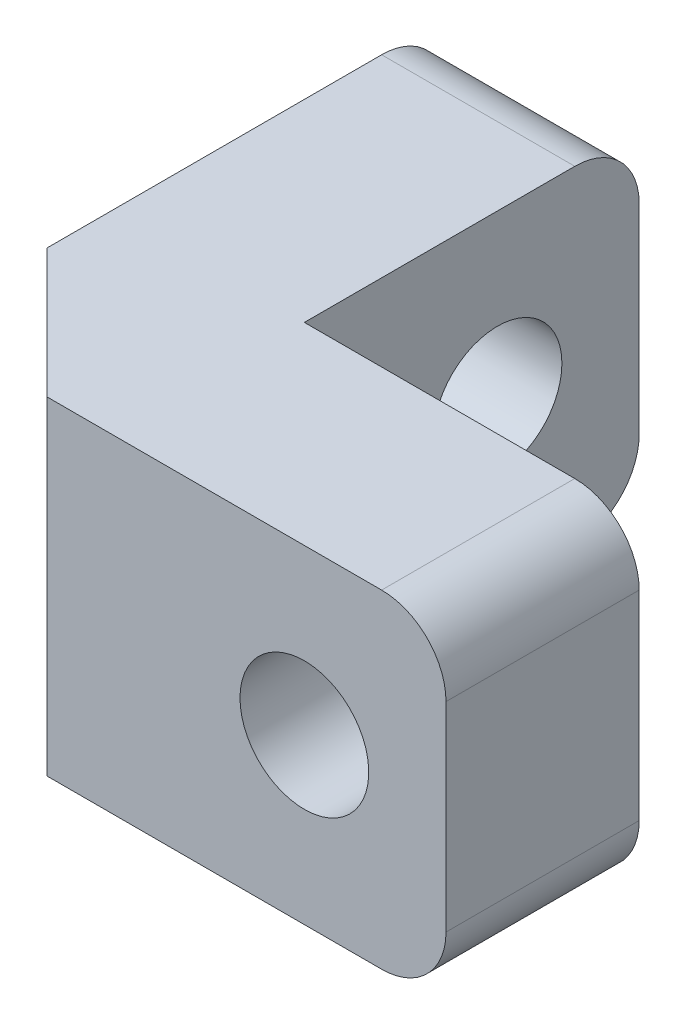
ISO-10303-21;
HEADER;
FILE_DESCRIPTION(('STEP AP214'),'2;1');
FILE_NAME('part.step','',(''),(''),'','','');
FILE_SCHEMA(('AUTOMOTIVE_DESIGN { 1 0 10303 214 1 1 1 1 }'));
ENDSEC;
DATA;
#1=APPLICATION_CONTEXT('core data for automotive mechanical design processes');
#2=APPLICATION_PROTOCOL_DEFINITION('international standard','automotive_design',2000,#1);
#3=PRODUCT_CONTEXT('',#1,'mechanical');
#4=PRODUCT('Part','Part','',(#3));
#5=PRODUCT_RELATED_PRODUCT_CATEGORY('part','',(#4));
#6=PRODUCT_DEFINITION_FORMATION('','',#4);
#7=PRODUCT_DEFINITION_CONTEXT('part definition',#1,'design');
#8=PRODUCT_DEFINITION('design','',#6,#7);
#9=PRODUCT_DEFINITION_SHAPE('','',#8);
#10=(LENGTH_UNIT() NAMED_UNIT(*) SI_UNIT(.MILLI.,.METRE.));
#11=(NAMED_UNIT(*) PLANE_ANGLE_UNIT() SI_UNIT($,.RADIAN.));
#12=(NAMED_UNIT(*) SI_UNIT($,.STERADIAN.) SOLID_ANGLE_UNIT());
#13=UNCERTAINTY_MEASURE_WITH_UNIT(LENGTH_MEASURE(1.E-05),#10,'distance_accuracy_value','');
#14=(GEOMETRIC_REPRESENTATION_CONTEXT(3) GLOBAL_UNCERTAINTY_ASSIGNED_CONTEXT((#13)) GLOBAL_UNIT_ASSIGNED_CONTEXT((#10,
#11,#12)) REPRESENTATION_CONTEXT('',''));
#15=CARTESIAN_POINT('',(0.,0.,0.));
#16=DIRECTION('',(0.,0.,1.));
#17=DIRECTION('',(1.,0.,0.));
#18=AXIS2_PLACEMENT_3D('',#15,#16,#17);
#19=CARTESIAN_POINT('',(4.7204,0.8296,1.4));
#20=DIRECTION('',(0.,0.,-1.));
#21=DIRECTION('',(-1.,0.,0.));
#22=AXIS2_PLACEMENT_3D('',#19,#20,#21);
#23=PLANE('',#22);
#24=CARTESIAN_POINT('',(3.,2.55,1.4));
#25=DIRECTION('',(0.,0.,-1.));
#26=DIRECTION('',(-1.,0.,0.));
#27=AXIS2_PLACEMENT_3D('',#24,#25,#26);
#28=CIRCLE('',#27,1.);
#29=CARTESIAN_POINT('',(2.,2.55,1.4));
#30=VERTEX_POINT('',#29);
#31=EDGE_CURVE('E21',#30,#30,#28,.T.);
#32=ORIENTED_EDGE('',*,*,#31,.F.);
#33=EDGE_LOOP('',(#32));
#34=FACE_BOUND('',#33,.T.);
#35=CARTESIAN_POINT('',(3.,2.55,1.4));
#36=DIRECTION('',(0.,0.,-1.));
#37=DIRECTION('',(-1.,0.,0.));
#38=AXIS2_PLACEMENT_3D('',#35,#36,#37);
#39=CIRCLE('',#38,1.7);
#40=CARTESIAN_POINT('',(1.3,2.55,1.4));
#41=VERTEX_POINT('',#40);
#42=EDGE_CURVE('E117',#41,#41,#39,.F.);
#43=ORIENTED_EDGE('',*,*,#42,.F.);
#44=EDGE_LOOP('',(#43));
#45=FACE_BOUND('',#44,.T.);
#46=ADVANCED_FACE('F17',(#34,#45),#23,.T.);
#47=CARTESIAN_POINT('',(3.,2.55,3.));
#48=DIRECTION('',(0.,0.,-1.));
#49=DIRECTION('',(-1.,0.,0.));
#50=AXIS2_PLACEMENT_3D('',#47,#48,#49);
#51=CYLINDRICAL_SURFACE('',#50,1.);
#52=CARTESIAN_POINT('',(3.,2.55,3.));
#53=DIRECTION('',(0.,0.,-1.));
#54=DIRECTION('',(-1.,0.,0.));
#55=AXIS2_PLACEMENT_3D('',#52,#53,#54);
#56=CIRCLE('',#55,1.);
#57=CARTESIAN_POINT('',(2.,2.55,3.));
#58=VERTEX_POINT('',#57);
#59=EDGE_CURVE('E115',#58,#58,#56,.F.);
#60=ORIENTED_EDGE('',*,*,#59,.T.);
#61=EDGE_LOOP('',(#60));
#62=FACE_BOUND('',#61,.T.);
#63=ORIENTED_EDGE('',*,*,#31,.T.);
#64=EDGE_LOOP('',(#63));
#65=FACE_BOUND('',#64,.T.);
#66=ADVANCED_FACE('F160',(#62,#65),#51,.F.);
#67=CARTESIAN_POINT('',(5.2,1.,0.));
#68=DIRECTION('',(-1.,0.,0.));
#69=DIRECTION('',(0.,0.,1.));
#70=AXIS2_PLACEMENT_3D('',#67,#68,#69);
#71=PLANE('',#70);
#72=DIRECTION('',(0.,0.,1.));
#73=VECTOR('',#72,1.);
#74=CARTESIAN_POINT('',(5.2,0.999999999589793,1.5));
#75=LINE('',#74,#73);
#76=CARTESIAN_POINT('',(5.2,0.999999999794897,3.));
#77=VERTEX_POINT('',#76);
#78=CARTESIAN_POINT('',(5.2,0.999999999794897,0.));
#79=VERTEX_POINT('',#78);
#80=EDGE_CURVE('E112',#77,#79,#75,.F.);
#81=ORIENTED_EDGE('',*,*,#80,.T.);
#82=DIRECTION('',(0.,1.,0.));
#83=VECTOR('',#82,1.);
#84=CARTESIAN_POINT('',(5.2,2.55,0.));
#85=LINE('',#84,#83);
#86=CARTESIAN_POINT('',(5.2,4.1,0.));
#87=VERTEX_POINT('',#86);
#88=EDGE_CURVE('E147',#79,#87,#85,.T.);
#89=ORIENTED_EDGE('',*,*,#88,.T.);
#90=DIRECTION('',(0.,0.,-1.));
#91=VECTOR('',#90,1.);
#92=CARTESIAN_POINT('',(5.2,4.1,1.5));
#93=LINE('',#92,#91);
#94=CARTESIAN_POINT('',(5.2,4.1,3.));
#95=VERTEX_POINT('',#94);
#96=EDGE_CURVE('E89',#87,#95,#93,.F.);
#97=ORIENTED_EDGE('',*,*,#96,.T.);
#98=DIRECTION('',(0.,-1.,0.));
#99=VECTOR('',#98,1.);
#100=CARTESIAN_POINT('',(5.2,2.55,3.));
#101=LINE('',#100,#99);
#102=EDGE_CURVE('E86',#95,#77,#101,.T.);
#103=ORIENTED_EDGE('',*,*,#102,.T.);
#104=EDGE_LOOP('',(#81,#89,#97,#103));
#105=FACE_BOUND('',#104,.T.);
#106=ADVANCED_FACE('F169',(#105),#71,.F.);
#107=CARTESIAN_POINT('',(3.,2.55,1.4));
#108=DIRECTION('',(0.,0.,-1.));
#109=DIRECTION('',(-1.,0.,0.));
#110=AXIS2_PLACEMENT_3D('',#107,#108,#109);
#111=CYLINDRICAL_SURFACE('',#110,1.7);
#112=ORIENTED_EDGE('',*,*,#42,.T.);
#113=EDGE_LOOP('',(#112));
#114=FACE_BOUND('',#113,.T.);
#115=CARTESIAN_POINT('',(3.,2.55,0.));
#116=DIRECTION('',(0.,0.,-1.));
#117=DIRECTION('',(-1.,0.,0.));
#118=AXIS2_PLACEMENT_3D('',#115,#116,#117);
#119=CIRCLE('',#118,1.7);
#120=CARTESIAN_POINT('',(1.3,2.55,0.));
#121=VERTEX_POINT('',#120);
#122=EDGE_CURVE('E144',#121,#121,#119,.T.);
#123=ORIENTED_EDGE('',*,*,#122,.T.);
#124=EDGE_LOOP('',(#123));
#125=FACE_BOUND('',#124,.T.);
#126=ADVANCED_FACE('F203',(#114,#125),#111,.F.);
#127=CARTESIAN_POINT('',(4.2,4.1,0.));
#128=DIRECTION('',(0.,0.,1.));
#129=DIRECTION('',(1.,0.,0.));
#130=AXIS2_PLACEMENT_3D('',#127,#128,#129);
#131=CYLINDRICAL_SURFACE('',#130,1.);
#132=ORIENTED_EDGE('',*,*,#96,.F.);
#133=CARTESIAN_POINT('',(4.2,4.1,0.));
#134=DIRECTION('',(0.,0.,1.));
#135=DIRECTION('',(1.,0.,0.));
#136=AXIS2_PLACEMENT_3D('',#133,#134,#135);
#137=CIRCLE('',#136,1.);
#138=CARTESIAN_POINT('',(4.2,5.1,-1.20000006025717E-09));
#139=VERTEX_POINT('',#138);
#140=EDGE_CURVE('E103',#87,#139,#137,.T.);
#141=ORIENTED_EDGE('',*,*,#140,.T.);
#142=DIRECTION('',(0.,0.,-1.));
#143=VECTOR('',#142,1.);
#144=CARTESIAN_POINT('',(4.2,5.1,-0.6));
#145=LINE('',#144,#143);
#146=CARTESIAN_POINT('',(4.2,5.1,3.));
#147=VERTEX_POINT('',#146);
#148=EDGE_CURVE('E95',#147,#139,#145,.T.);
#149=ORIENTED_EDGE('',*,*,#148,.F.);
#150=CARTESIAN_POINT('',(4.2,4.1,3.));
#151=DIRECTION('',(0.,0.,1.));
#152=DIRECTION('',(1.,0.,0.));
#153=AXIS2_PLACEMENT_3D('',#150,#151,#152);
#154=CIRCLE('',#153,1.);
#155=EDGE_CURVE('E77',#147,#95,#154,.F.);
#156=ORIENTED_EDGE('',*,*,#155,.T.);
#157=EDGE_LOOP('',(#132,#141,#149,#156));
#158=FACE_BOUND('',#157,.T.);
#159=ADVANCED_FACE('F101',(#158),#131,.T.);
#160=CARTESIAN_POINT('',(5.2,0.,3.));
#161=DIRECTION('',(0.,0.,-1.));
#162=DIRECTION('',(-1.,0.,0.));
#163=AXIS2_PLACEMENT_3D('',#160,#161,#162);
#164=PLANE('',#163);
#165=ORIENTED_EDGE('',*,*,#59,.F.);
#166=EDGE_LOOP('',(#165));
#167=FACE_BOUND('',#166,.T.);
#168=CARTESIAN_POINT('',(4.2,1.,3.));
#169=DIRECTION('',(0.,0.,-1.));
#170=DIRECTION('',(-1.,0.,0.));
#171=AXIS2_PLACEMENT_3D('',#168,#169,#170);
#172=CIRCLE('',#171,1.);
#173=CARTESIAN_POINT('',(4.2,0.,3.));
#174=VERTEX_POINT('',#173);
#175=EDGE_CURVE('E114',#174,#77,#172,.F.);
#176=ORIENTED_EDGE('',*,*,#175,.T.);
#177=ORIENTED_EDGE('',*,*,#102,.F.);
#178=ORIENTED_EDGE('',*,*,#155,.F.);
#179=DIRECTION('',(1.,0.,0.));
#180=VECTOR('',#179,1.);
#181=CARTESIAN_POINT('',(0.6,5.1,3.));
#182=LINE('',#181,#180);
#183=CARTESIAN_POINT('',(-1.,5.1,3.));
#184=VERTEX_POINT('',#183);
#185=EDGE_CURVE('E83',#184,#147,#182,.T.);
#186=ORIENTED_EDGE('',*,*,#185,.F.);
#187=DIRECTION('',(0.,-1.,0.));
#188=VECTOR('',#187,1.);
#189=CARTESIAN_POINT('',(-1.,2.55,3.));
#190=LINE('',#189,#188);
#191=CARTESIAN_POINT('',(-1.,0.,3.));
#192=VERTEX_POINT('',#191);
#193=EDGE_CURVE('E246',#184,#192,#190,.T.);
#194=ORIENTED_EDGE('',*,*,#193,.T.);
#195=DIRECTION('',(1.,0.,0.));
#196=VECTOR('',#195,1.);
#197=CARTESIAN_POINT('',(0.6,0.,3.));
#198=LINE('',#197,#196);
#199=EDGE_CURVE('E130',#192,#174,#198,.T.);
#200=ORIENTED_EDGE('',*,*,#199,.T.);
#201=EDGE_LOOP('',(#176,#177,#178,#186,#194,#200));
#202=FACE_BOUND('',#201,.T.);
#203=ADVANCED_FACE('F80',(#167,#202),#164,.F.);
#204=CARTESIAN_POINT('',(4.2,1.,3.));
#205=DIRECTION('',(0.,0.,-1.));
#206=DIRECTION('',(-1.,0.,0.));
#207=AXIS2_PLACEMENT_3D('',#204,#205,#206);
#208=CYLINDRICAL_SURFACE('',#207,1.);
#209=DIRECTION('',(0.,0.,-1.));
#210=VECTOR('',#209,1.);
#211=CARTESIAN_POINT('',(4.2,0.,-0.6));
#212=LINE('',#211,#210);
#213=CARTESIAN_POINT('',(4.2,0.,-1.20000006025717E-09));
#214=VERTEX_POINT('',#213);
#215=EDGE_CURVE('E228',#174,#214,#212,.T.);
#216=ORIENTED_EDGE('',*,*,#215,.T.);
#217=CARTESIAN_POINT('',(4.2,1.,0.));
#218=DIRECTION('',(0.,0.,-1.));
#219=DIRECTION('',(-1.,0.,0.));
#220=AXIS2_PLACEMENT_3D('',#217,#218,#219);
#221=CIRCLE('',#220,1.);
#222=EDGE_CURVE('E148',#214,#79,#221,.F.);
#223=ORIENTED_EDGE('',*,*,#222,.T.);
#224=ORIENTED_EDGE('',*,*,#80,.F.);
#225=ORIENTED_EDGE('',*,*,#175,.F.);
#226=EDGE_LOOP('',(#216,#223,#224,#225));
#227=FACE_BOUND('',#226,.T.);
#228=ADVANCED_FACE('F197',(#227),#208,.T.);
#229=CARTESIAN_POINT('',(0.,0.,0.));
#230=DIRECTION('',(0.,0.,1.));
#231=DIRECTION('',(1.,0.,0.));
#232=AXIS2_PLACEMENT_3D('',#229,#230,#231);
#233=PLANE('',#232);
#234=ORIENTED_EDGE('',*,*,#122,.F.);
#235=EDGE_LOOP('',(#234));
#236=FACE_BOUND('',#235,.T.);
#237=ORIENTED_EDGE('',*,*,#222,.F.);
#238=DIRECTION('',(-1.,0.,0.));
#239=VECTOR('',#238,1.);
#240=CARTESIAN_POINT('',(0.6,0.,-2.40000012051433E-09));
#241=LINE('',#240,#239);
#242=CARTESIAN_POINT('',(1.60000051402376E-09,0.,-1.60000008034289E-09));
#243=VERTEX_POINT('',#242);
#244=EDGE_CURVE('E220',#214,#243,#241,.T.);
#245=ORIENTED_EDGE('',*,*,#244,.T.);
#246=DIRECTION('',(0.,1.,0.));
#247=VECTOR('',#246,1.);
#248=CARTESIAN_POINT('',(0.,2.55,0.));
#249=LINE('',#248,#247);
#250=CARTESIAN_POINT('',(1.20000038551782E-09,5.1,-1.60000008034289E-09));
#251=VERTEX_POINT('',#250);
#252=EDGE_CURVE('E140',#243,#251,#249,.T.);
#253=ORIENTED_EDGE('',*,*,#252,.T.);
#254=DIRECTION('',(-1.,0.,0.));
#255=VECTOR('',#254,1.);
#256=CARTESIAN_POINT('',(0.6,5.1,-2.40000012051433E-09));
#257=LINE('',#256,#255);
#258=EDGE_CURVE('E105',#139,#251,#257,.T.);
#259=ORIENTED_EDGE('',*,*,#258,.F.);
#260=ORIENTED_EDGE('',*,*,#140,.F.);
#261=ORIENTED_EDGE('',*,*,#88,.F.);
#262=EDGE_LOOP('',(#237,#245,#253,#259,#260,#261));
#263=FACE_BOUND('',#262,.T.);
#264=ADVANCED_FACE('F195',(#236,#263),#233,.F.);
#265=CARTESIAN_POINT('',(-3.,4.1,-4.2));
#266=DIRECTION('',(1.,0.,0.));
#267=DIRECTION('',(0.,0.,-1.));
#268=AXIS2_PLACEMENT_3D('',#265,#266,#267);
#269=CYLINDRICAL_SURFACE('',#268,1.);
#270=DIRECTION('',(-1.,0.,0.));
#271=VECTOR('',#270,1.);
#272=CARTESIAN_POINT('',(-1.5,4.1,-5.2));
#273=LINE('',#272,#271);
#274=CARTESIAN_POINT('',(0.,4.1,-5.2));
#275=VERTEX_POINT('',#274);
#276=CARTESIAN_POINT('',(-3.,4.1,-5.2));
#277=VERTEX_POINT('',#276);
#278=EDGE_CURVE('E233',#275,#277,#273,.T.);
#279=ORIENTED_EDGE('',*,*,#278,.T.);
#280=CARTESIAN_POINT('',(-3.,4.1,-4.2));
#281=DIRECTION('',(1.,0.,0.));
#282=DIRECTION('',(0.,0.,-1.));
#283=AXIS2_PLACEMENT_3D('',#280,#281,#282);
#284=CIRCLE('',#283,1.);
#285=CARTESIAN_POINT('',(-3.,5.1,-4.2));
#286=VERTEX_POINT('',#285);
#287=EDGE_CURVE('E142',#286,#277,#284,.F.);
#288=ORIENTED_EDGE('',*,*,#287,.F.);
#289=DIRECTION('',(-1.,0.,0.));
#290=VECTOR('',#289,1.);
#291=CARTESIAN_POINT('',(0.6,5.1,-4.2));
#292=LINE('',#291,#290);
#293=CARTESIAN_POINT('',(1.20000038551782E-09,5.1,-4.2));
#294=VERTEX_POINT('',#293);
#295=EDGE_CURVE('E248',#294,#286,#292,.T.);
#296=ORIENTED_EDGE('',*,*,#295,.F.);
#297=CARTESIAN_POINT('',(0.,4.1,-4.2));
#298=DIRECTION('',(1.,0.,0.));
#299=DIRECTION('',(0.,0.,-1.));
#300=AXIS2_PLACEMENT_3D('',#297,#298,#299);
#301=CIRCLE('',#300,1.);
#302=EDGE_CURVE('E137',#294,#275,#301,.F.);
#303=ORIENTED_EDGE('',*,*,#302,.T.);
#304=EDGE_LOOP('',(#279,#288,#296,#303));
#305=FACE_BOUND('',#304,.T.);
#306=ADVANCED_FACE('F192',(#305),#269,.T.);
#307=CARTESIAN_POINT('',(0.,1.,-4.2));
#308=DIRECTION('',(-1.,0.,0.));
#309=DIRECTION('',(0.,0.,1.));
#310=AXIS2_PLACEMENT_3D('',#307,#308,#309);
#311=CYLINDRICAL_SURFACE('',#310,1.);
#312=DIRECTION('',(-1.,0.,0.));
#313=VECTOR('',#312,1.);
#314=CARTESIAN_POINT('',(0.6,0.,-4.2));
#315=LINE('',#314,#313);
#316=CARTESIAN_POINT('',(1.20000038551782E-09,0.,-4.2));
#317=VERTEX_POINT('',#316);
#318=CARTESIAN_POINT('',(-3.,0.,-4.2));
#319=VERTEX_POINT('',#318);
#320=EDGE_CURVE('E131',#317,#319,#315,.T.);
#321=ORIENTED_EDGE('',*,*,#320,.T.);
#322=CARTESIAN_POINT('',(-3.,1.,-4.2));
#323=DIRECTION('',(-1.,0.,0.));
#324=DIRECTION('',(0.,0.,1.));
#325=AXIS2_PLACEMENT_3D('',#322,#323,#324);
#326=CIRCLE('',#325,1.);
#327=CARTESIAN_POINT('',(-3.,1.,-5.2));
#328=VERTEX_POINT('',#327);
#329=EDGE_CURVE('E36',#328,#319,#326,.T.);
#330=ORIENTED_EDGE('',*,*,#329,.F.);
#331=DIRECTION('',(1.,0.,0.));
#332=VECTOR('',#331,1.);
#333=CARTESIAN_POINT('',(-1.5,1.,-5.2));
#334=LINE('',#333,#332);
#335=CARTESIAN_POINT('',(0.,1.,-5.2));
#336=VERTEX_POINT('',#335);
#337=EDGE_CURVE('E269',#328,#336,#334,.T.);
#338=ORIENTED_EDGE('',*,*,#337,.T.);
#339=CARTESIAN_POINT('',(0.,1.,-4.2));
#340=DIRECTION('',(-1.,0.,0.));
#341=DIRECTION('',(0.,0.,1.));
#342=AXIS2_PLACEMENT_3D('',#339,#340,#341);
#343=CIRCLE('',#342,1.);
#344=EDGE_CURVE('E134',#336,#317,#343,.T.);
#345=ORIENTED_EDGE('',*,*,#344,.T.);
#346=EDGE_LOOP('',(#321,#330,#338,#345));
#347=FACE_BOUND('',#346,.T.);
#348=ADVANCED_FACE('F189',(#347),#311,.T.);
#349=CARTESIAN_POINT('',(0.,0.,-5.2));
#350=DIRECTION('',(-1.,0.,0.));
#351=DIRECTION('',(0.,0.,1.));
#352=AXIS2_PLACEMENT_3D('',#349,#350,#351);
#353=PLANE('',#352);
#354=CARTESIAN_POINT('',(0.,2.55,-3.));
#355=DIRECTION('',(1.,0.,0.));
#356=DIRECTION('',(0.,0.,-1.));
#357=AXIS2_PLACEMENT_3D('',#354,#355,#356);
#358=CIRCLE('',#357,1.);
#359=CARTESIAN_POINT('',(0.,2.55,-4.));
#360=VERTEX_POINT('',#359);
#361=EDGE_CURVE('E99',#360,#360,#358,.T.);
#362=ORIENTED_EDGE('',*,*,#361,.F.);
#363=EDGE_LOOP('',(#362));
#364=FACE_BOUND('',#363,.T.);
#365=ORIENTED_EDGE('',*,*,#344,.F.);
#366=DIRECTION('',(0.,1.,0.));
#367=VECTOR('',#366,1.);
#368=CARTESIAN_POINT('',(0.,2.55,-5.2));
#369=LINE('',#368,#367);
#370=EDGE_CURVE('E126',#336,#275,#369,.T.);
#371=ORIENTED_EDGE('',*,*,#370,.T.);
#372=ORIENTED_EDGE('',*,*,#302,.F.);
#373=DIRECTION('',(0.,0.,-1.));
#374=VECTOR('',#373,1.);
#375=CARTESIAN_POINT('',(2.40000077103564E-09,5.1,-0.6));
#376=LINE('',#375,#374);
#377=EDGE_CURVE('E107',#251,#294,#376,.T.);
#378=ORIENTED_EDGE('',*,*,#377,.F.);
#379=ORIENTED_EDGE('',*,*,#252,.F.);
#380=DIRECTION('',(0.,0.,-1.));
#381=VECTOR('',#380,1.);
#382=CARTESIAN_POINT('',(2.40000077103564E-09,0.,-0.6));
#383=LINE('',#382,#381);
#384=EDGE_CURVE('E232',#243,#317,#383,.T.);
#385=ORIENTED_EDGE('',*,*,#384,.T.);
#386=EDGE_LOOP('',(#365,#371,#372,#378,#379,#385));
#387=FACE_BOUND('',#386,.T.);
#388=ADVANCED_FACE('F187',(#364,#387),#353,.F.);
#389=CARTESIAN_POINT('',(-1.6,2.55,-3.));
#390=DIRECTION('',(1.,0.,0.));
#391=DIRECTION('',(0.,0.,-1.));
#392=AXIS2_PLACEMENT_3D('',#389,#390,#391);
#393=CYLINDRICAL_SURFACE('',#392,1.);
#394=ORIENTED_EDGE('',*,*,#361,.T.);
#395=EDGE_LOOP('',(#394));
#396=FACE_BOUND('',#395,.T.);
#397=CARTESIAN_POINT('',(-1.6,2.55,-3.));
#398=DIRECTION('',(1.,0.,0.));
#399=DIRECTION('',(0.,0.,-1.));
#400=AXIS2_PLACEMENT_3D('',#397,#398,#399);
#401=CIRCLE('',#400,1.);
#402=CARTESIAN_POINT('',(-1.6,2.55,-4.));
#403=VERTEX_POINT('',#402);
#404=EDGE_CURVE('E122',#403,#403,#401,.T.);
#405=ORIENTED_EDGE('',*,*,#404,.F.);
#406=EDGE_LOOP('',(#405));
#407=FACE_BOUND('',#406,.T.);
#408=ADVANCED_FACE('F184',(#396,#407),#393,.F.);
#409=CARTESIAN_POINT('',(-3.,5.1,-4.2));
#410=DIRECTION('',(0.,1.,0.));
#411=DIRECTION('',(0.,0.,1.));
#412=AXIS2_PLACEMENT_3D('',#409,#410,#411);
#413=PLANE('',#412);
#414=DIRECTION('',(0.,0.,1.));
#415=VECTOR('',#414,1.);
#416=CARTESIAN_POINT('',(-3.,5.1,-2.1));
#417=LINE('',#416,#415);
#418=CARTESIAN_POINT('',(-3.,5.1,1.));
#419=VERTEX_POINT('',#418);
#420=EDGE_CURVE('E125',#286,#419,#417,.T.);
#421=ORIENTED_EDGE('',*,*,#420,.T.);
#422=DIRECTION('',(0.707106781186548,0.,0.707106781186548));
#423=VECTOR('',#422,1.);
#424=CARTESIAN_POINT('',(-2.,5.1,2.));
#425=LINE('',#424,#423);
#426=EDGE_CURVE('E98',#419,#184,#425,.T.);
#427=ORIENTED_EDGE('',*,*,#426,.T.);
#428=ORIENTED_EDGE('',*,*,#185,.T.);
#429=ORIENTED_EDGE('',*,*,#148,.T.);
#430=ORIENTED_EDGE('',*,*,#258,.T.);
#431=ORIENTED_EDGE('',*,*,#377,.T.);
#432=ORIENTED_EDGE('',*,*,#295,.T.);
#433=EDGE_LOOP('',(#421,#427,#428,#429,#430,#431,#432));
#434=FACE_BOUND('',#433,.T.);
#435=ADVANCED_FACE('F93',(#434),#413,.T.);
#436=CARTESIAN_POINT('',(-1.,5.1,3.));
#437=DIRECTION('',(0.707106781186547,0.,-0.707106781186547));
#438=DIRECTION('',(0.,-1.,0.));
#439=AXIS2_PLACEMENT_3D('',#436,#437,#438);
#440=PLANE('',#439);
#441=DIRECTION('',(0.,-1.,0.));
#442=VECTOR('',#441,1.);
#443=CARTESIAN_POINT('',(-3.,2.55,1.));
#444=LINE('',#443,#442);
#445=CARTESIAN_POINT('',(-3.,0.,1.));
#446=VERTEX_POINT('',#445);
#447=EDGE_CURVE('E282',#419,#446,#444,.T.);
#448=ORIENTED_EDGE('',*,*,#447,.T.);
#449=DIRECTION('',(-0.707106781186547,0.,-0.707106781186547));
#450=VECTOR('',#449,1.);
#451=CARTESIAN_POINT('',(-1.,0.,3.));
#452=LINE('',#451,#450);
#453=EDGE_CURVE('E127',#446,#192,#452,.F.);
#454=ORIENTED_EDGE('',*,*,#453,.T.);
#455=ORIENTED_EDGE('',*,*,#193,.F.);
#456=ORIENTED_EDGE('',*,*,#426,.F.);
#457=EDGE_LOOP('',(#448,#454,#455,#456));
#458=FACE_BOUND('',#457,.T.);
#459=ADVANCED_FACE('F311',(#458),#440,.F.);
#460=CARTESIAN_POINT('',(-3.,0.,-4.2));
#461=DIRECTION('',(0.,1.,0.));
#462=DIRECTION('',(0.,0.,1.));
#463=AXIS2_PLACEMENT_3D('',#460,#461,#462);
#464=PLANE('',#463);
#465=ORIENTED_EDGE('',*,*,#215,.F.);
#466=ORIENTED_EDGE('',*,*,#199,.F.);
#467=ORIENTED_EDGE('',*,*,#453,.F.);
#468=DIRECTION('',(0.,0.,-1.));
#469=VECTOR('',#468,1.);
#470=CARTESIAN_POINT('',(-3.,0.,-2.1));
#471=LINE('',#470,#469);
#472=EDGE_CURVE('E285',#446,#319,#471,.T.);
#473=ORIENTED_EDGE('',*,*,#472,.T.);
#474=ORIENTED_EDGE('',*,*,#320,.F.);
#475=ORIENTED_EDGE('',*,*,#384,.F.);
#476=ORIENTED_EDGE('',*,*,#244,.F.);
#477=EDGE_LOOP('',(#465,#466,#467,#473,#474,#475,#476));
#478=FACE_BOUND('',#477,.T.);
#479=ADVANCED_FACE('F226',(#478),#464,.F.);
#480=CARTESIAN_POINT('',(-3.,1.,-5.2));
#481=DIRECTION('',(0.,0.,1.));
#482=DIRECTION('',(1.,0.,0.));
#483=AXIS2_PLACEMENT_3D('',#480,#481,#482);
#484=PLANE('',#483);
#485=ORIENTED_EDGE('',*,*,#337,.F.);
#486=DIRECTION('',(0.,1.,0.));
#487=VECTOR('',#486,1.);
#488=CARTESIAN_POINT('',(-3.,2.55,-5.2));
#489=LINE('',#488,#487);
#490=EDGE_CURVE('E121',#328,#277,#489,.T.);
#491=ORIENTED_EDGE('',*,*,#490,.T.);
#492=ORIENTED_EDGE('',*,*,#278,.F.);
#493=ORIENTED_EDGE('',*,*,#370,.F.);
#494=EDGE_LOOP('',(#485,#491,#492,#493));
#495=FACE_BOUND('',#494,.T.);
#496=ADVANCED_FACE('F296',(#495),#484,.F.);
#497=CARTESIAN_POINT('',(-1.6,0.8296,-4.7204));
#498=DIRECTION('',(-1.,0.,0.));
#499=DIRECTION('',(0.,0.,1.));
#500=AXIS2_PLACEMENT_3D('',#497,#498,#499);
#501=PLANE('',#500);
#502=ORIENTED_EDGE('',*,*,#404,.T.);
#503=EDGE_LOOP('',(#502));
#504=FACE_BOUND('',#503,.T.);
#505=CARTESIAN_POINT('',(-1.6,2.55,-3.));
#506=DIRECTION('',(-1.,0.,0.));
#507=DIRECTION('',(0.,0.,1.));
#508=AXIS2_PLACEMENT_3D('',#505,#506,#507);
#509=CIRCLE('',#508,1.7);
#510=CARTESIAN_POINT('',(-1.6,2.55,-1.3));
#511=VERTEX_POINT('',#510);
#512=EDGE_CURVE('E27',#511,#511,#509,.F.);
#513=ORIENTED_EDGE('',*,*,#512,.F.);
#514=EDGE_LOOP('',(#513));
#515=FACE_BOUND('',#514,.T.);
#516=ADVANCED_FACE('F180',(#504,#515),#501,.T.);
#517=CARTESIAN_POINT('',(-3.,0.,1.));
#518=DIRECTION('',(1.,0.,0.));
#519=DIRECTION('',(0.,0.,-1.));
#520=AXIS2_PLACEMENT_3D('',#517,#518,#519);
#521=PLANE('',#520);
#522=CARTESIAN_POINT('',(-3.,2.55,-3.));
#523=DIRECTION('',(-1.,0.,0.));
#524=DIRECTION('',(0.,0.,1.));
#525=AXIS2_PLACEMENT_3D('',#522,#523,#524);
#526=CIRCLE('',#525,1.7);
#527=CARTESIAN_POINT('',(-3.,2.55,-1.3));
#528=VERTEX_POINT('',#527);
#529=EDGE_CURVE('E11',#528,#528,#526,.T.);
#530=ORIENTED_EDGE('',*,*,#529,.F.);
#531=EDGE_LOOP('',(#530));
#532=FACE_BOUND('',#531,.T.);
#533=ORIENTED_EDGE('',*,*,#329,.T.);
#534=ORIENTED_EDGE('',*,*,#472,.F.);
#535=ORIENTED_EDGE('',*,*,#447,.F.);
#536=ORIENTED_EDGE('',*,*,#420,.F.);
#537=ORIENTED_EDGE('',*,*,#287,.T.);
#538=ORIENTED_EDGE('',*,*,#490,.F.);
#539=EDGE_LOOP('',(#533,#534,#535,#536,#537,#538));
#540=FACE_BOUND('',#539,.T.);
#541=ADVANCED_FACE('F19',(#532,#540),#521,.F.);
#542=CARTESIAN_POINT('',(-1.6,2.55,-3.));
#543=DIRECTION('',(-1.,0.,0.));
#544=DIRECTION('',(0.,0.,1.));
#545=AXIS2_PLACEMENT_3D('',#542,#543,#544);
#546=CYLINDRICAL_SURFACE('',#545,1.7);
#547=ORIENTED_EDGE('',*,*,#512,.T.);
#548=EDGE_LOOP('',(#547));
#549=FACE_BOUND('',#548,.T.);
#550=ORIENTED_EDGE('',*,*,#529,.T.);
#551=EDGE_LOOP('',(#550));
#552=FACE_BOUND('',#551,.T.);
#553=ADVANCED_FACE('F173',(#549,#552),#546,.F.);
#554=CLOSED_SHELL('',(#46,#66,#106,#126,#159,#203,#228,#264,#306,#348,#388,#408,#435,#459,#479,
#496,#516,#541,#553));
#555=MANIFOLD_SOLID_BREP('B1',#554);
#556=ADVANCED_BREP_SHAPE_REPRESENTATION('',(#18,#555),#14);
#557=SHAPE_DEFINITION_REPRESENTATION(#9,#556);
ENDSEC;
END-ISO-10303-21;
